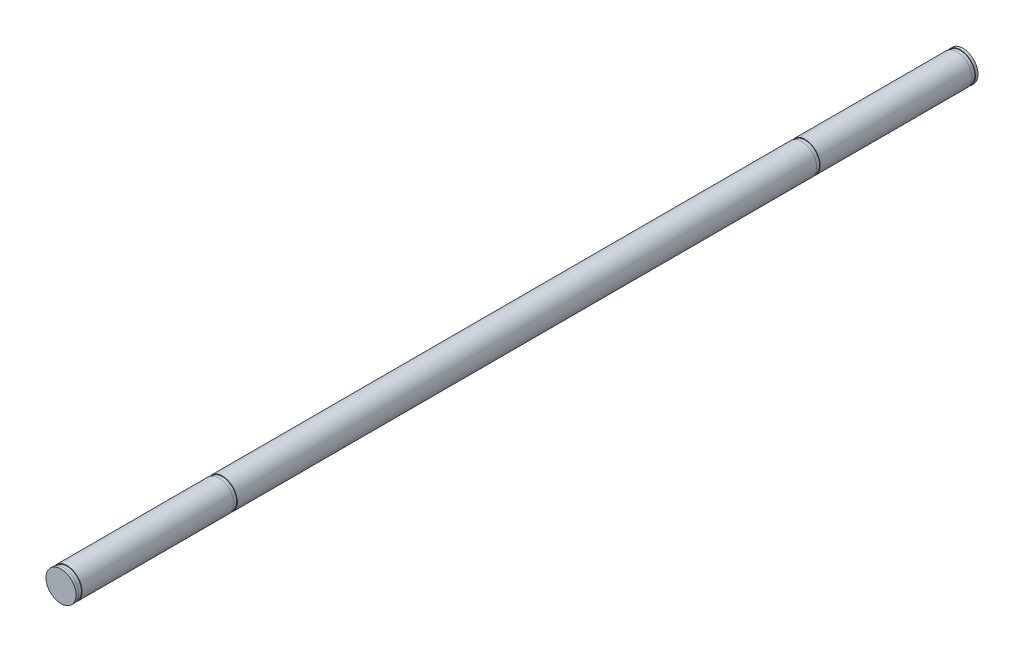
ISO-10303-21;
HEADER;
FILE_DESCRIPTION(('STEP AP214'),'2;1');
FILE_NAME('part.step','',(''),(''),'','','');
FILE_SCHEMA(('AUTOMOTIVE_DESIGN { 1 0 10303 214 1 1 1 1 }'));
ENDSEC;
DATA;
#1=APPLICATION_CONTEXT('core data for automotive mechanical design processes');
#2=APPLICATION_PROTOCOL_DEFINITION('international standard','automotive_design',2000,#1);
#3=PRODUCT_CONTEXT('',#1,'mechanical');
#4=PRODUCT('Part','Part','',(#3));
#5=PRODUCT_RELATED_PRODUCT_CATEGORY('part','',(#4));
#6=PRODUCT_DEFINITION_FORMATION('','',#4);
#7=PRODUCT_DEFINITION_CONTEXT('part definition',#1,'design');
#8=PRODUCT_DEFINITION('design','',#6,#7);
#9=PRODUCT_DEFINITION_SHAPE('','',#8);
#10=(LENGTH_UNIT() NAMED_UNIT(*) SI_UNIT(.MILLI.,.METRE.));
#11=(NAMED_UNIT(*) PLANE_ANGLE_UNIT() SI_UNIT($,.RADIAN.));
#12=(NAMED_UNIT(*) SI_UNIT($,.STERADIAN.) SOLID_ANGLE_UNIT());
#13=UNCERTAINTY_MEASURE_WITH_UNIT(LENGTH_MEASURE(1.E-05),#10,'distance_accuracy_value','');
#14=(GEOMETRIC_REPRESENTATION_CONTEXT(3) GLOBAL_UNCERTAINTY_ASSIGNED_CONTEXT((#13)) GLOBAL_UNIT_ASSIGNED_CONTEXT((#10,
#11,#12)) REPRESENTATION_CONTEXT('',''));
#15=CARTESIAN_POINT('',(0.,0.,0.));
#16=DIRECTION('',(0.,0.,1.));
#17=DIRECTION('',(1.,0.,0.));
#18=AXIS2_PLACEMENT_3D('',#15,#16,#17);
#19=CARTESIAN_POINT('',(0.,0.,150.));
#20=DIRECTION('',(0.,0.,-1.));
#21=DIRECTION('',(-1.,0.,0.));
#22=AXIS2_PLACEMENT_3D('',#19,#20,#21);
#23=CYLINDRICAL_SURFACE('',#22,5.);
#24=CARTESIAN_POINT('',(0.,0.,96.35));
#25=DIRECTION('',(0.,0.,1.));
#26=DIRECTION('',(1.,0.,0.));
#27=AXIS2_PLACEMENT_3D('',#24,#25,#26);
#28=CIRCLE('',#27,5.);
#29=CARTESIAN_POINT('',(5.,0.,96.35));
#30=VERTEX_POINT('',#29);
#31=EDGE_CURVE('E55',#30,#30,#28,.T.);
#32=ORIENTED_EDGE('',*,*,#31,.F.);
#33=EDGE_LOOP('',(#32));
#34=FACE_BOUND('',#33,.T.);
#35=CARTESIAN_POINT('',(0.,0.,-96.35));
#36=DIRECTION('',(0.,0.,1.));
#37=DIRECTION('',(1.,0.,0.));
#38=AXIS2_PLACEMENT_3D('',#35,#36,#37);
#39=CIRCLE('',#38,5.);
#40=CARTESIAN_POINT('',(5.,0.,-96.35));
#41=VERTEX_POINT('',#40);
#42=EDGE_CURVE('E79',#41,#41,#39,.T.);
#43=ORIENTED_EDGE('',*,*,#42,.T.);
#44=EDGE_LOOP('',(#43));
#45=FACE_BOUND('',#44,.T.);
#46=ADVANCED_FACE('F33',(#34,#45),#23,.T.);
#47=CARTESIAN_POINT('',(0.,0.,149.15));
#48=DIRECTION('',(0.,0.,1.));
#49=DIRECTION('',(1.,0.,0.));
#50=AXIS2_PLACEMENT_3D('',#47,#48,#49);
#51=CIRCLE('',#50,5.);
#52=CARTESIAN_POINT('',(5.,0.,149.15));
#53=VERTEX_POINT('',#52);
#54=EDGE_CURVE('E44',#53,#53,#51,.T.);
#55=ORIENTED_EDGE('',*,*,#54,.T.);
#56=EDGE_LOOP('',(#55));
#57=FACE_BOUND('',#56,.T.);
#58=CARTESIAN_POINT('',(0.,0.,150.));
#59=DIRECTION('',(0.,0.,1.));
#60=DIRECTION('',(1.,0.,0.));
#61=AXIS2_PLACEMENT_3D('',#58,#59,#60);
#62=CIRCLE('',#61,5.);
#63=CARTESIAN_POINT('',(5.,0.,150.));
#64=VERTEX_POINT('',#63);
#65=EDGE_CURVE('E10',#64,#64,#62,.T.);
#66=ORIENTED_EDGE('',*,*,#65,.F.);
#67=EDGE_LOOP('',(#66));
#68=FACE_BOUND('',#67,.T.);
#69=ADVANCED_FACE('F35',(#57,#68),#23,.T.);
#70=CARTESIAN_POINT('',(0.,0.,150.));
#71=DIRECTION('',(0.,0.,1.));
#72=DIRECTION('',(1.,0.,0.));
#73=AXIS2_PLACEMENT_3D('',#70,#71,#72);
#74=PLANE('',#73);
#75=ORIENTED_EDGE('',*,*,#65,.T.);
#76=EDGE_LOOP('',(#75));
#77=FACE_BOUND('',#76,.T.);
#78=ADVANCED_FACE('F120',(#77),#74,.T.);
#79=CARTESIAN_POINT('',(0.,0.,149.15));
#80=DIRECTION('',(0.,0.,1.));
#81=DIRECTION('',(1.,0.,0.));
#82=AXIS2_PLACEMENT_3D('',#79,#80,#81);
#83=PLANE('',#82);
#84=ORIENTED_EDGE('',*,*,#54,.F.);
#85=EDGE_LOOP('',(#84));
#86=FACE_BOUND('',#85,.T.);
#87=CARTESIAN_POINT('',(0.,0.,149.15));
#88=DIRECTION('',(0.,0.,1.));
#89=DIRECTION('',(1.,0.,0.));
#90=AXIS2_PLACEMENT_3D('',#87,#88,#89);
#91=CIRCLE('',#90,4.8);
#92=CARTESIAN_POINT('',(4.8,0.,149.15));
#93=VERTEX_POINT('',#92);
#94=EDGE_CURVE('E49',#93,#93,#91,.T.);
#95=ORIENTED_EDGE('',*,*,#94,.T.);
#96=EDGE_LOOP('',(#95));
#97=FACE_BOUND('',#96,.T.);
#98=ADVANCED_FACE('F169',(#86,#97),#83,.F.);
#99=CARTESIAN_POINT('',(0.,0.,148.));
#100=DIRECTION('',(0.,0.,1.));
#101=DIRECTION('',(1.,0.,0.));
#102=AXIS2_PLACEMENT_3D('',#99,#100,#101);
#103=PLANE('',#102);
#104=CARTESIAN_POINT('',(0.,0.,148.));
#105=DIRECTION('',(0.,0.,1.));
#106=DIRECTION('',(1.,0.,0.));
#107=AXIS2_PLACEMENT_3D('',#104,#105,#106);
#108=CIRCLE('',#107,5.);
#109=CARTESIAN_POINT('',(5.,0.,148.));
#110=VERTEX_POINT('',#109);
#111=EDGE_CURVE('E46',#110,#110,#108,.T.);
#112=ORIENTED_EDGE('',*,*,#111,.T.);
#113=EDGE_LOOP('',(#112));
#114=FACE_BOUND('',#113,.T.);
#115=CARTESIAN_POINT('',(0.,0.,148.));
#116=DIRECTION('',(0.,0.,1.));
#117=DIRECTION('',(1.,0.,0.));
#118=AXIS2_PLACEMENT_3D('',#115,#116,#117);
#119=CIRCLE('',#118,4.8);
#120=CARTESIAN_POINT('',(4.8,0.,148.));
#121=VERTEX_POINT('',#120);
#122=EDGE_CURVE('E52',#121,#121,#119,.T.);
#123=ORIENTED_EDGE('',*,*,#122,.F.);
#124=EDGE_LOOP('',(#123));
#125=FACE_BOUND('',#124,.T.);
#126=ADVANCED_FACE('F160',(#114,#125),#103,.T.);
#127=CARTESIAN_POINT('',(0.,0.,149.15));
#128=DIRECTION('',(0.,0.,-1.));
#129=DIRECTION('',(-1.,0.,0.));
#130=AXIS2_PLACEMENT_3D('',#127,#128,#129);
#131=CYLINDRICAL_SURFACE('',#130,4.8);
#132=ORIENTED_EDGE('',*,*,#94,.F.);
#133=EDGE_LOOP('',(#132));
#134=FACE_BOUND('',#133,.T.);
#135=ORIENTED_EDGE('',*,*,#122,.T.);
#136=EDGE_LOOP('',(#135));
#137=FACE_BOUND('',#136,.T.);
#138=ADVANCED_FACE('F151',(#134,#137),#131,.T.);
#139=CARTESIAN_POINT('',(0.,0.,97.5));
#140=DIRECTION('',(0.,0.,1.));
#141=DIRECTION('',(1.,0.,0.));
#142=AXIS2_PLACEMENT_3D('',#139,#140,#141);
#143=CIRCLE('',#142,5.);
#144=CARTESIAN_POINT('',(5.,0.,97.5));
#145=VERTEX_POINT('',#144);
#146=EDGE_CURVE('E58',#145,#145,#143,.T.);
#147=ORIENTED_EDGE('',*,*,#146,.T.);
#148=EDGE_LOOP('',(#147));
#149=FACE_BOUND('',#148,.T.);
#150=ORIENTED_EDGE('',*,*,#111,.F.);
#151=EDGE_LOOP('',(#150));
#152=FACE_BOUND('',#151,.T.);
#153=ADVANCED_FACE('F122',(#149,#152),#23,.T.);
#154=CARTESIAN_POINT('',(0.,0.,96.35));
#155=DIRECTION('',(0.,0.,1.));
#156=DIRECTION('',(1.,0.,0.));
#157=AXIS2_PLACEMENT_3D('',#154,#155,#156);
#158=PLANE('',#157);
#159=CARTESIAN_POINT('',(0.,0.,96.35));
#160=DIRECTION('',(0.,0.,1.));
#161=DIRECTION('',(1.,0.,0.));
#162=AXIS2_PLACEMENT_3D('',#159,#160,#161);
#163=CIRCLE('',#162,4.8);
#164=CARTESIAN_POINT('',(4.8,0.,96.35));
#165=VERTEX_POINT('',#164);
#166=EDGE_CURVE('E61',#165,#165,#163,.T.);
#167=ORIENTED_EDGE('',*,*,#166,.F.);
#168=EDGE_LOOP('',(#167));
#169=FACE_BOUND('',#168,.T.);
#170=ORIENTED_EDGE('',*,*,#31,.T.);
#171=EDGE_LOOP('',(#170));
#172=FACE_BOUND('',#171,.T.);
#173=ADVANCED_FACE('F150',(#169,#172),#158,.T.);
#174=CARTESIAN_POINT('',(0.,0.,97.5));
#175=DIRECTION('',(0.,0.,1.));
#176=DIRECTION('',(1.,0.,0.));
#177=AXIS2_PLACEMENT_3D('',#174,#175,#176);
#178=PLANE('',#177);
#179=CARTESIAN_POINT('',(0.,0.,97.5));
#180=DIRECTION('',(0.,0.,1.));
#181=DIRECTION('',(1.,0.,0.));
#182=AXIS2_PLACEMENT_3D('',#179,#180,#181);
#183=CIRCLE('',#182,4.8);
#184=CARTESIAN_POINT('',(4.8,0.,97.5));
#185=VERTEX_POINT('',#184);
#186=EDGE_CURVE('E64',#185,#185,#183,.T.);
#187=ORIENTED_EDGE('',*,*,#186,.T.);
#188=EDGE_LOOP('',(#187));
#189=FACE_BOUND('',#188,.T.);
#190=ORIENTED_EDGE('',*,*,#146,.F.);
#191=EDGE_LOOP('',(#190));
#192=FACE_BOUND('',#191,.T.);
#193=ADVANCED_FACE('F157',(#189,#192),#178,.F.);
#194=CARTESIAN_POINT('',(0.,0.,96.35));
#195=DIRECTION('',(0.,0.,1.));
#196=DIRECTION('',(1.,0.,0.));
#197=AXIS2_PLACEMENT_3D('',#194,#195,#196);
#198=CYLINDRICAL_SURFACE('',#197,4.8);
#199=ORIENTED_EDGE('',*,*,#166,.T.);
#200=EDGE_LOOP('',(#199));
#201=FACE_BOUND('',#200,.T.);
#202=ORIENTED_EDGE('',*,*,#186,.F.);
#203=EDGE_LOOP('',(#202));
#204=FACE_BOUND('',#203,.T.);
#205=ADVANCED_FACE('F110',(#201,#204),#198,.T.);
#206=CARTESIAN_POINT('',(0.,0.,-96.35));
#207=DIRECTION('',(0.,0.,-1.));
#208=DIRECTION('',(1.,0.,0.));
#209=AXIS2_PLACEMENT_3D('',#206,#207,#208);
#210=PLANE('',#209);
#211=ORIENTED_EDGE('',*,*,#42,.F.);
#212=EDGE_LOOP('',(#211));
#213=FACE_BOUND('',#212,.T.);
#214=CARTESIAN_POINT('',(0.,0.,-96.35));
#215=DIRECTION('',(0.,0.,1.));
#216=DIRECTION('',(1.,0.,0.));
#217=AXIS2_PLACEMENT_3D('',#214,#215,#216);
#218=CIRCLE('',#217,4.8);
#219=CARTESIAN_POINT('',(4.8,0.,-96.35));
#220=VERTEX_POINT('',#219);
#221=EDGE_CURVE('E85',#220,#220,#218,.T.);
#222=ORIENTED_EDGE('',*,*,#221,.T.);
#223=EDGE_LOOP('',(#222));
#224=FACE_BOUND('',#223,.T.);
#225=ADVANCED_FACE('F94',(#213,#224),#210,.T.);
#226=CARTESIAN_POINT('',(0.,0.,-97.5));
#227=DIRECTION('',(0.,0.,-1.));
#228=DIRECTION('',(1.,0.,0.));
#229=AXIS2_PLACEMENT_3D('',#226,#227,#228);
#230=PLANE('',#229);
#231=CARTESIAN_POINT('',(0.,0.,-97.5));
#232=DIRECTION('',(0.,0.,1.));
#233=DIRECTION('',(1.,0.,0.));
#234=AXIS2_PLACEMENT_3D('',#231,#232,#233);
#235=CIRCLE('',#234,5.);
#236=CARTESIAN_POINT('',(5.,0.,-97.5));
#237=VERTEX_POINT('',#236);
#238=EDGE_CURVE('E82',#237,#237,#235,.T.);
#239=ORIENTED_EDGE('',*,*,#238,.T.);
#240=EDGE_LOOP('',(#239));
#241=FACE_BOUND('',#240,.T.);
#242=CARTESIAN_POINT('',(0.,0.,-97.5));
#243=DIRECTION('',(0.,0.,1.));
#244=DIRECTION('',(1.,0.,0.));
#245=AXIS2_PLACEMENT_3D('',#242,#243,#244);
#246=CIRCLE('',#245,4.8);
#247=CARTESIAN_POINT('',(4.8,0.,-97.5));
#248=VERTEX_POINT('',#247);
#249=EDGE_CURVE('E88',#248,#248,#246,.T.);
#250=ORIENTED_EDGE('',*,*,#249,.F.);
#251=EDGE_LOOP('',(#250));
#252=FACE_BOUND('',#251,.T.);
#253=ADVANCED_FACE('F100',(#241,#252),#230,.F.);
#254=CARTESIAN_POINT('',(0.,0.,-96.35));
#255=DIRECTION('',(0.,0.,-1.));
#256=DIRECTION('',(-1.,0.,0.));
#257=AXIS2_PLACEMENT_3D('',#254,#255,#256);
#258=CYLINDRICAL_SURFACE('',#257,4.8);
#259=ORIENTED_EDGE('',*,*,#221,.F.);
#260=EDGE_LOOP('',(#259));
#261=FACE_BOUND('',#260,.T.);
#262=ORIENTED_EDGE('',*,*,#249,.T.);
#263=EDGE_LOOP('',(#262));
#264=FACE_BOUND('',#263,.T.);
#265=ADVANCED_FACE('F96',(#261,#264),#258,.T.);
#266=CARTESIAN_POINT('',(0.,0.,-150.));
#267=DIRECTION('',(0.,0.,1.));
#268=DIRECTION('',(1.,0.,0.));
#269=AXIS2_PLACEMENT_3D('',#266,#267,#268);
#270=PLANE('',#269);
#271=CARTESIAN_POINT('',(0.,0.,-150.));
#272=DIRECTION('',(0.,0.,1.));
#273=DIRECTION('',(1.,0.,0.));
#274=AXIS2_PLACEMENT_3D('',#271,#272,#273);
#275=CIRCLE('',#274,5.);
#276=CARTESIAN_POINT('',(5.,0.,-150.));
#277=VERTEX_POINT('',#276);
#278=EDGE_CURVE('E37',#277,#277,#275,.T.);
#279=ORIENTED_EDGE('',*,*,#278,.F.);
#280=EDGE_LOOP('',(#279));
#281=FACE_BOUND('',#280,.T.);
#282=ADVANCED_FACE('F99',(#281),#270,.F.);
#283=CARTESIAN_POINT('',(0.,0.,-149.15));
#284=DIRECTION('',(0.,0.,1.));
#285=DIRECTION('',(1.,0.,0.));
#286=AXIS2_PLACEMENT_3D('',#283,#284,#285);
#287=CIRCLE('',#286,5.);
#288=CARTESIAN_POINT('',(5.,0.,-149.15));
#289=VERTEX_POINT('',#288);
#290=EDGE_CURVE('E67',#289,#289,#287,.T.);
#291=ORIENTED_EDGE('',*,*,#290,.F.);
#292=EDGE_LOOP('',(#291));
#293=FACE_BOUND('',#292,.T.);
#294=ORIENTED_EDGE('',*,*,#278,.T.);
#295=EDGE_LOOP('',(#294));
#296=FACE_BOUND('',#295,.T.);
#297=ADVANCED_FACE('F128',(#293,#296),#23,.T.);
#298=CARTESIAN_POINT('',(0.,0.,-149.15));
#299=DIRECTION('',(0.,0.,-1.));
#300=DIRECTION('',(1.,0.,0.));
#301=AXIS2_PLACEMENT_3D('',#298,#299,#300);
#302=PLANE('',#301);
#303=CARTESIAN_POINT('',(0.,0.,-149.15));
#304=DIRECTION('',(0.,0.,1.));
#305=DIRECTION('',(1.,0.,0.));
#306=AXIS2_PLACEMENT_3D('',#303,#304,#305);
#307=CIRCLE('',#306,4.8);
#308=CARTESIAN_POINT('',(4.8,0.,-149.15));
#309=VERTEX_POINT('',#308);
#310=EDGE_CURVE('E73',#309,#309,#307,.T.);
#311=ORIENTED_EDGE('',*,*,#310,.F.);
#312=EDGE_LOOP('',(#311));
#313=FACE_BOUND('',#312,.T.);
#314=ORIENTED_EDGE('',*,*,#290,.T.);
#315=EDGE_LOOP('',(#314));
#316=FACE_BOUND('',#315,.T.);
#317=ADVANCED_FACE('F138',(#313,#316),#302,.F.);
#318=CARTESIAN_POINT('',(0.,0.,-149.15));
#319=DIRECTION('',(0.,0.,1.));
#320=DIRECTION('',(1.,0.,0.));
#321=AXIS2_PLACEMENT_3D('',#318,#319,#320);
#322=CYLINDRICAL_SURFACE('',#321,4.8);
#323=ORIENTED_EDGE('',*,*,#310,.T.);
#324=EDGE_LOOP('',(#323));
#325=FACE_BOUND('',#324,.T.);
#326=CARTESIAN_POINT('',(0.,0.,-148.));
#327=DIRECTION('',(0.,0.,1.));
#328=DIRECTION('',(1.,0.,0.));
#329=AXIS2_PLACEMENT_3D('',#326,#327,#328);
#330=CIRCLE('',#329,4.8);
#331=CARTESIAN_POINT('',(4.8,0.,-148.));
#332=VERTEX_POINT('',#331);
#333=EDGE_CURVE('E76',#332,#332,#330,.T.);
#334=ORIENTED_EDGE('',*,*,#333,.F.);
#335=EDGE_LOOP('',(#334));
#336=FACE_BOUND('',#335,.T.);
#337=ADVANCED_FACE('F132',(#325,#336),#322,.T.);
#338=CARTESIAN_POINT('',(0.,0.,-148.));
#339=DIRECTION('',(0.,0.,-1.));
#340=DIRECTION('',(1.,0.,0.));
#341=AXIS2_PLACEMENT_3D('',#338,#339,#340);
#342=PLANE('',#341);
#343=ORIENTED_EDGE('',*,*,#333,.T.);
#344=EDGE_LOOP('',(#343));
#345=FACE_BOUND('',#344,.T.);
#346=CARTESIAN_POINT('',(0.,0.,-148.));
#347=DIRECTION('',(0.,0.,1.));
#348=DIRECTION('',(1.,0.,0.));
#349=AXIS2_PLACEMENT_3D('',#346,#347,#348);
#350=CIRCLE('',#349,5.);
#351=CARTESIAN_POINT('',(5.,0.,-148.));
#352=VERTEX_POINT('',#351);
#353=EDGE_CURVE('E70',#352,#352,#350,.T.);
#354=ORIENTED_EDGE('',*,*,#353,.F.);
#355=EDGE_LOOP('',(#354));
#356=FACE_BOUND('',#355,.T.);
#357=ADVANCED_FACE('F126',(#345,#356),#342,.T.);
#358=ORIENTED_EDGE('',*,*,#238,.F.);
#359=EDGE_LOOP('',(#358));
#360=FACE_BOUND('',#359,.T.);
#361=ORIENTED_EDGE('',*,*,#353,.T.);
#362=EDGE_LOOP('',(#361));
#363=FACE_BOUND('',#362,.T.);
#364=ADVANCED_FACE('F116',(#360,#363),#23,.T.);
#365=CLOSED_SHELL('',(#46,#69,#78,#98,#126,#138,#153,#173,#193,#205,#225,#253,#265,#282,#297,
#317,#337,#357,#364));
#366=MANIFOLD_SOLID_BREP('B2',#365);
#367=ADVANCED_BREP_SHAPE_REPRESENTATION('',(#18,#366),#14);
#368=SHAPE_DEFINITION_REPRESENTATION(#9,#367);
ENDSEC;
END-ISO-10303-21;
